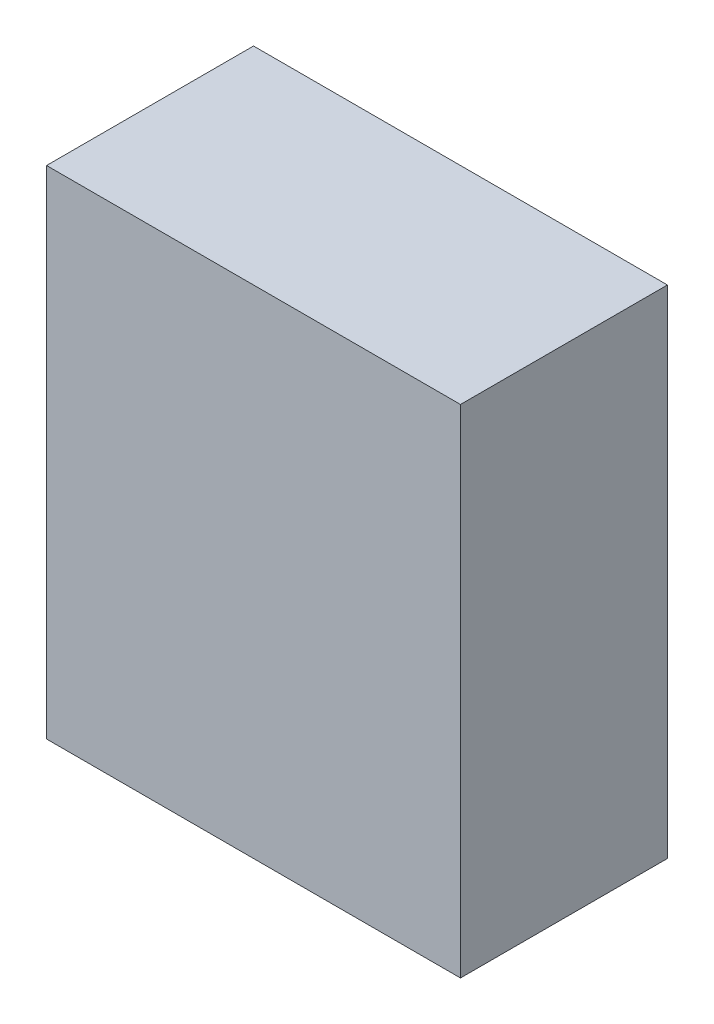
ISO-10303-21;
HEADER;
FILE_DESCRIPTION(('STEP AP214'),'2;1');
FILE_NAME('part.step','',(''),(''),'','','');
FILE_SCHEMA(('AUTOMOTIVE_DESIGN { 1 0 10303 214 1 1 1 1 }'));
ENDSEC;
DATA;
#1=APPLICATION_CONTEXT('core data for automotive mechanical design processes');
#2=APPLICATION_PROTOCOL_DEFINITION('international standard','automotive_design',2000,#1);
#3=PRODUCT_CONTEXT('',#1,'mechanical');
#4=PRODUCT('Part','Part','',(#3));
#5=PRODUCT_RELATED_PRODUCT_CATEGORY('part','',(#4));
#6=PRODUCT_DEFINITION_FORMATION('','',#4);
#7=PRODUCT_DEFINITION_CONTEXT('part definition',#1,'design');
#8=PRODUCT_DEFINITION('design','',#6,#7);
#9=PRODUCT_DEFINITION_SHAPE('','',#8);
#10=(LENGTH_UNIT() NAMED_UNIT(*) SI_UNIT(.MILLI.,.METRE.));
#11=(NAMED_UNIT(*) PLANE_ANGLE_UNIT() SI_UNIT($,.RADIAN.));
#12=(NAMED_UNIT(*) SI_UNIT($,.STERADIAN.) SOLID_ANGLE_UNIT());
#13=UNCERTAINTY_MEASURE_WITH_UNIT(LENGTH_MEASURE(1.E-05),#10,'distance_accuracy_value','');
#14=(GEOMETRIC_REPRESENTATION_CONTEXT(3) GLOBAL_UNCERTAINTY_ASSIGNED_CONTEXT((#13)) GLOBAL_UNIT_ASSIGNED_CONTEXT((#10,
#11,#12)) REPRESENTATION_CONTEXT('',''));
#15=CARTESIAN_POINT('',(0.,0.,0.));
#16=DIRECTION('',(0.,0.,1.));
#17=DIRECTION('',(1.,0.,0.));
#18=AXIS2_PLACEMENT_3D('',#15,#16,#17);
#19=CARTESIAN_POINT('',(25.,60.,12.5));
#20=DIRECTION('',(-1.,0.,0.));
#21=DIRECTION('',(0.,0.,1.));
#22=AXIS2_PLACEMENT_3D('',#19,#20,#21);
#23=PLANE('',#22);
#24=DIRECTION('',(0.,0.,-1.));
#25=VECTOR('',#24,1.);
#26=CARTESIAN_POINT('',(25.,0.,12.5));
#27=LINE('',#26,#25);
#28=CARTESIAN_POINT('',(25.,0.,12.5));
#29=VERTEX_POINT('',#28);
#30=CARTESIAN_POINT('',(25.,0.,-12.5));
#31=VERTEX_POINT('',#30);
#32=EDGE_CURVE('E100',#29,#31,#27,.T.);
#33=ORIENTED_EDGE('',*,*,#32,.T.);
#34=DIRECTION('',(0.,-1.,0.));
#35=VECTOR('',#34,1.);
#36=CARTESIAN_POINT('',(25.,60.,-12.5));
#37=LINE('',#36,#35);
#38=CARTESIAN_POINT('',(25.,60.,-12.5));
#39=VERTEX_POINT('',#38);
#40=EDGE_CURVE('E11',#39,#31,#37,.T.);
#41=ORIENTED_EDGE('',*,*,#40,.F.);
#42=DIRECTION('',(0.,0.,-1.));
#43=VECTOR('',#42,1.);
#44=CARTESIAN_POINT('',(25.,60.,12.5));
#45=LINE('',#44,#43);
#46=CARTESIAN_POINT('',(25.,60.,12.5));
#47=VERTEX_POINT('',#46);
#48=EDGE_CURVE('E88',#47,#39,#45,.T.);
#49=ORIENTED_EDGE('',*,*,#48,.F.);
#50=DIRECTION('',(0.,-1.,0.));
#51=VECTOR('',#50,1.);
#52=CARTESIAN_POINT('',(25.,60.,12.5));
#53=LINE('',#52,#51);
#54=EDGE_CURVE('E96',#47,#29,#53,.T.);
#55=ORIENTED_EDGE('',*,*,#54,.T.);
#56=EDGE_LOOP('',(#33,#41,#49,#55));
#57=FACE_BOUND('',#56,.T.);
#58=ADVANCED_FACE('F37',(#57),#23,.F.);
#59=CARTESIAN_POINT('',(-25.,60.,-12.5));
#60=DIRECTION('',(0.,0.,1.));
#61=DIRECTION('',(1.,0.,0.));
#62=AXIS2_PLACEMENT_3D('',#59,#60,#61);
#63=PLANE('',#62);
#64=DIRECTION('',(-1.,0.,0.));
#65=VECTOR('',#64,1.);
#66=CARTESIAN_POINT('',(-25.,0.,-12.5));
#67=LINE('',#66,#65);
#68=CARTESIAN_POINT('',(-25.,0.,-12.5));
#69=VERTEX_POINT('',#68);
#70=EDGE_CURVE('E92',#31,#69,#67,.T.);
#71=ORIENTED_EDGE('',*,*,#70,.T.);
#72=DIRECTION('',(0.,-1.,0.));
#73=VECTOR('',#72,1.);
#74=CARTESIAN_POINT('',(-25.,60.,-12.5));
#75=LINE('',#74,#73);
#76=CARTESIAN_POINT('',(-25.,60.,-12.5));
#77=VERTEX_POINT('',#76);
#78=EDGE_CURVE('E45',#77,#69,#75,.T.);
#79=ORIENTED_EDGE('',*,*,#78,.F.);
#80=DIRECTION('',(-1.,0.,0.));
#81=VECTOR('',#80,1.);
#82=CARTESIAN_POINT('',(-25.,60.,-12.5));
#83=LINE('',#82,#81);
#84=EDGE_CURVE('E83',#39,#77,#83,.T.);
#85=ORIENTED_EDGE('',*,*,#84,.F.);
#86=ORIENTED_EDGE('',*,*,#40,.T.);
#87=EDGE_LOOP('',(#71,#79,#85,#86));
#88=FACE_BOUND('',#87,.T.);
#89=ADVANCED_FACE('F91',(#88),#63,.F.);
#90=CARTESIAN_POINT('',(-25.,60.,12.5));
#91=DIRECTION('',(1.,0.,0.));
#92=DIRECTION('',(0.,0.,-1.));
#93=AXIS2_PLACEMENT_3D('',#90,#91,#92);
#94=PLANE('',#93);
#95=DIRECTION('',(0.,0.,1.));
#96=VECTOR('',#95,1.);
#97=CARTESIAN_POINT('',(-25.,0.,12.5));
#98=LINE('',#97,#96);
#99=CARTESIAN_POINT('',(-25.,0.,12.5));
#100=VERTEX_POINT('',#99);
#101=EDGE_CURVE('E70',#69,#100,#98,.T.);
#102=ORIENTED_EDGE('',*,*,#101,.T.);
#103=DIRECTION('',(0.,-1.,0.));
#104=VECTOR('',#103,1.);
#105=CARTESIAN_POINT('',(-25.,60.,12.5));
#106=LINE('',#105,#104);
#107=CARTESIAN_POINT('',(-25.,60.,12.5));
#108=VERTEX_POINT('',#107);
#109=EDGE_CURVE('E93',#108,#100,#106,.T.);
#110=ORIENTED_EDGE('',*,*,#109,.F.);
#111=DIRECTION('',(0.,0.,1.));
#112=VECTOR('',#111,1.);
#113=CARTESIAN_POINT('',(-25.,60.,12.5));
#114=LINE('',#113,#112);
#115=EDGE_CURVE('E86',#77,#108,#114,.T.);
#116=ORIENTED_EDGE('',*,*,#115,.F.);
#117=ORIENTED_EDGE('',*,*,#78,.T.);
#118=EDGE_LOOP('',(#102,#110,#116,#117));
#119=FACE_BOUND('',#118,.T.);
#120=ADVANCED_FACE('F94',(#119),#94,.F.);
#121=CARTESIAN_POINT('',(-25.,60.,12.5));
#122=DIRECTION('',(0.,0.,-1.));
#123=DIRECTION('',(-1.,0.,0.));
#124=AXIS2_PLACEMENT_3D('',#121,#122,#123);
#125=PLANE('',#124);
#126=DIRECTION('',(1.,0.,0.));
#127=VECTOR('',#126,1.);
#128=CARTESIAN_POINT('',(-25.,0.,12.5));
#129=LINE('',#128,#127);
#130=EDGE_CURVE('E76',#100,#29,#129,.T.);
#131=ORIENTED_EDGE('',*,*,#130,.T.);
#132=ORIENTED_EDGE('',*,*,#54,.F.);
#133=DIRECTION('',(1.,0.,0.));
#134=VECTOR('',#133,1.);
#135=CARTESIAN_POINT('',(-25.,60.,12.5));
#136=LINE('',#135,#134);
#137=EDGE_CURVE('E53',#108,#47,#136,.T.);
#138=ORIENTED_EDGE('',*,*,#137,.F.);
#139=ORIENTED_EDGE('',*,*,#109,.T.);
#140=EDGE_LOOP('',(#131,#132,#138,#139));
#141=FACE_BOUND('',#140,.T.);
#142=ADVANCED_FACE('F107',(#141),#125,.F.);
#143=CARTESIAN_POINT('',(0.,60.,0.));
#144=DIRECTION('',(0.,-1.,0.));
#145=DIRECTION('',(0.,0.,-1.));
#146=AXIS2_PLACEMENT_3D('',#143,#144,#145);
#147=PLANE('',#146);
#148=ORIENTED_EDGE('',*,*,#48,.T.);
#149=ORIENTED_EDGE('',*,*,#84,.T.);
#150=ORIENTED_EDGE('',*,*,#115,.T.);
#151=ORIENTED_EDGE('',*,*,#137,.T.);
#152=EDGE_LOOP('',(#148,#149,#150,#151));
#153=FACE_BOUND('',#152,.T.);
#154=ADVANCED_FACE('F84',(#153),#147,.F.);
#155=CARTESIAN_POINT('',(0.,0.,0.));
#156=DIRECTION('',(0.,-1.,0.));
#157=DIRECTION('',(0.,0.,-1.));
#158=AXIS2_PLACEMENT_3D('',#155,#156,#157);
#159=PLANE('',#158);
#160=ORIENTED_EDGE('',*,*,#32,.F.);
#161=ORIENTED_EDGE('',*,*,#130,.F.);
#162=ORIENTED_EDGE('',*,*,#101,.F.);
#163=ORIENTED_EDGE('',*,*,#70,.F.);
#164=EDGE_LOOP('',(#160,#161,#162,#163));
#165=FACE_BOUND('',#164,.T.);
#166=ADVANCED_FACE('F110',(#165),#159,.T.);
#167=CLOSED_SHELL('',(#58,#89,#120,#142,#154,#166));
#168=MANIFOLD_SOLID_BREP('B2',#167);
#169=ADVANCED_BREP_SHAPE_REPRESENTATION('',(#18,#168),#14);
#170=SHAPE_DEFINITION_REPRESENTATION(#9,#169);
ENDSEC;
END-ISO-10303-21;
